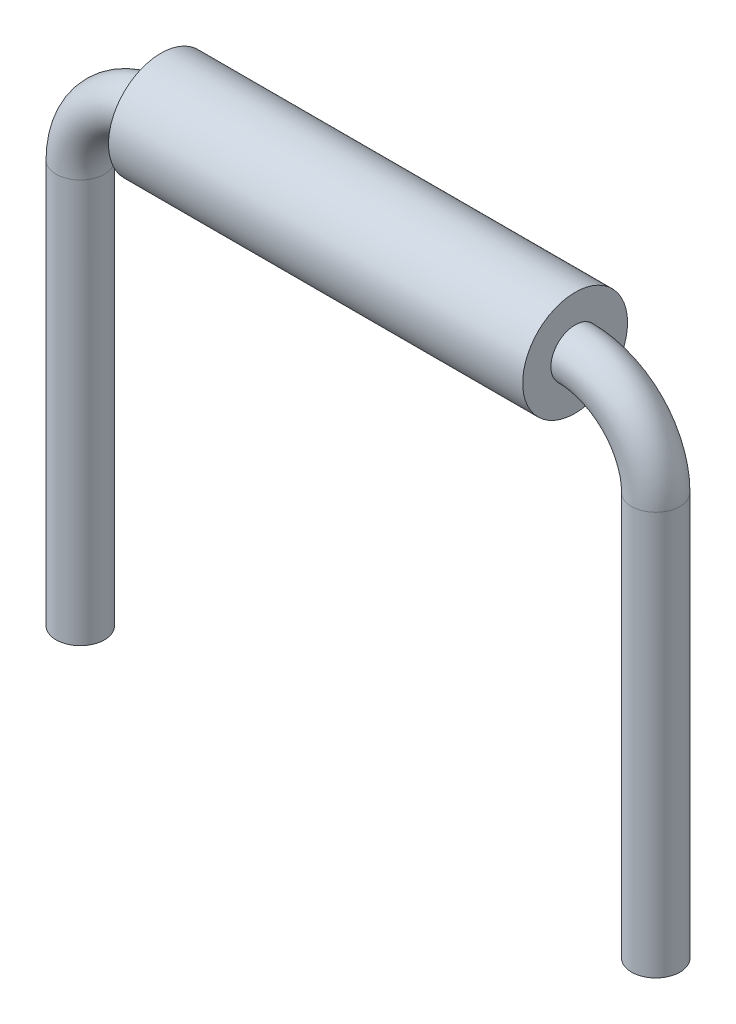
ISO-10303-21;
HEADER;
FILE_DESCRIPTION(('STEP AP214'),'2;1');
FILE_NAME('part.step','',(''),(''),'','','');
FILE_SCHEMA(('AUTOMOTIVE_DESIGN { 1 0 10303 214 1 1 1 1 }'));
ENDSEC;
DATA;
#1=APPLICATION_CONTEXT('core data for automotive mechanical design processes');
#2=APPLICATION_PROTOCOL_DEFINITION('international standard','automotive_design',2000,#1);
#3=PRODUCT_CONTEXT('',#1,'mechanical');
#4=PRODUCT('Part','Part','',(#3));
#5=PRODUCT_RELATED_PRODUCT_CATEGORY('part','',(#4));
#6=PRODUCT_DEFINITION_FORMATION('','',#4);
#7=PRODUCT_DEFINITION_CONTEXT('part definition',#1,'design');
#8=PRODUCT_DEFINITION('design','',#6,#7);
#9=PRODUCT_DEFINITION_SHAPE('','',#8);
#10=(LENGTH_UNIT() NAMED_UNIT(*) SI_UNIT(.MILLI.,.METRE.));
#11=(NAMED_UNIT(*) PLANE_ANGLE_UNIT() SI_UNIT($,.RADIAN.));
#12=(NAMED_UNIT(*) SI_UNIT($,.STERADIAN.) SOLID_ANGLE_UNIT());
#13=UNCERTAINTY_MEASURE_WITH_UNIT(LENGTH_MEASURE(1.E-05),#10,'distance_accuracy_value','');
#14=(GEOMETRIC_REPRESENTATION_CONTEXT(3) GLOBAL_UNCERTAINTY_ASSIGNED_CONTEXT((#13)) GLOBAL_UNIT_ASSIGNED_CONTEXT((#10,
#11,#12)) REPRESENTATION_CONTEXT('',''));
#15=CARTESIAN_POINT('',(0.,0.,0.));
#16=DIRECTION('',(0.,0.,1.));
#17=DIRECTION('',(1.,0.,0.));
#18=AXIS2_PLACEMENT_3D('',#15,#16,#17);
#19=CARTESIAN_POINT('',(2.5675,0.,0.));
#20=DIRECTION('',(1.,0.,0.));
#21=DIRECTION('',(0.,0.,-1.));
#22=AXIS2_PLACEMENT_3D('',#19,#20,#21);
#23=PLANE('',#22);
#24=CARTESIAN_POINT('',(2.5675,0.,0.));
#25=DIRECTION('',(1.,0.,0.));
#26=DIRECTION('',(0.,0.,-1.));
#27=AXIS2_PLACEMENT_3D('',#24,#25,#26);
#28=CIRCLE('',#27,0.65);
#29=CARTESIAN_POINT('',(2.5675,0.,-0.65));
#30=VERTEX_POINT('',#29);
#31=EDGE_CURVE('E11',#30,#30,#28,.T.);
#32=ORIENTED_EDGE('',*,*,#31,.T.);
#33=EDGE_LOOP('',(#32));
#34=FACE_BOUND('',#33,.T.);
#35=CARTESIAN_POINT('',(2.5675,0.,0.));
#36=DIRECTION('',(1.,0.,0.));
#37=DIRECTION('',(0.,0.,-1.));
#38=AXIS2_PLACEMENT_3D('',#35,#36,#37);
#39=CIRCLE('',#38,0.3);
#40=CARTESIAN_POINT('',(2.5675,0.,-0.3));
#41=VERTEX_POINT('',#40);
#42=EDGE_CURVE('E52',#41,#41,#39,.T.);
#43=ORIENTED_EDGE('',*,*,#42,.F.);
#44=EDGE_LOOP('',(#43));
#45=FACE_BOUND('',#44,.T.);
#46=ADVANCED_FACE('F45',(#34,#45),#23,.T.);
#47=CARTESIAN_POINT('',(2.5675,0.,0.));
#48=DIRECTION('',(-1.,0.,0.));
#49=DIRECTION('',(0.,0.,1.));
#50=AXIS2_PLACEMENT_3D('',#47,#48,#49);
#51=CYLINDRICAL_SURFACE('',#50,0.65);
#52=ORIENTED_EDGE('',*,*,#31,.F.);
#53=EDGE_LOOP('',(#52));
#54=FACE_BOUND('',#53,.T.);
#55=CARTESIAN_POINT('',(-2.5675,0.,0.));
#56=DIRECTION('',(1.,0.,0.));
#57=DIRECTION('',(0.,0.,-1.));
#58=AXIS2_PLACEMENT_3D('',#55,#56,#57);
#59=CIRCLE('',#58,0.65);
#60=CARTESIAN_POINT('',(-2.5675,0.,-0.65));
#61=VERTEX_POINT('',#60);
#62=EDGE_CURVE('E56',#61,#61,#59,.T.);
#63=ORIENTED_EDGE('',*,*,#62,.T.);
#64=EDGE_LOOP('',(#63));
#65=FACE_BOUND('',#64,.T.);
#66=ADVANCED_FACE('F47',(#54,#65),#51,.T.);
#67=CARTESIAN_POINT('',(2.5675,0.,0.));
#68=DIRECTION('',(-1.,0.,0.));
#69=DIRECTION('',(0.,0.,1.));
#70=AXIS2_PLACEMENT_3D('',#67,#68,#69);
#71=CYLINDRICAL_SURFACE('',#70,0.3);
#72=ORIENTED_EDGE('',*,*,#42,.T.);
#73=EDGE_LOOP('',(#72));
#74=FACE_BOUND('',#73,.T.);
#75=CARTESIAN_POINT('',(-2.5675,0.,0.));
#76=DIRECTION('',(1.,0.,0.));
#77=DIRECTION('',(0.,0.,-1.));
#78=AXIS2_PLACEMENT_3D('',#75,#76,#77);
#79=CIRCLE('',#78,0.3);
#80=CARTESIAN_POINT('',(-2.5675,0.,-0.3));
#81=VERTEX_POINT('',#80);
#82=EDGE_CURVE('E60',#81,#81,#79,.T.);
#83=ORIENTED_EDGE('',*,*,#82,.F.);
#84=EDGE_LOOP('',(#83));
#85=FACE_BOUND('',#84,.T.);
#86=ADVANCED_FACE('F69',(#74,#85),#71,.F.);
#87=CARTESIAN_POINT('',(-2.5675,0.,0.));
#88=DIRECTION('',(1.,0.,0.));
#89=DIRECTION('',(0.,0.,-1.));
#90=AXIS2_PLACEMENT_3D('',#87,#88,#89);
#91=PLANE('',#90);
#92=ORIENTED_EDGE('',*,*,#82,.T.);
#93=EDGE_LOOP('',(#92));
#94=FACE_BOUND('',#93,.T.);
#95=ORIENTED_EDGE('',*,*,#62,.F.);
#96=EDGE_LOOP('',(#95));
#97=FACE_BOUND('',#96,.T.);
#98=ADVANCED_FACE('F66',(#94,#97),#91,.F.);
#99=CLOSED_SHELL('',(#46,#66,#86,#98));
#100=MANIFOLD_SOLID_BREP('B2',#99);
#101=CARTESIAN_POINT('',(3.5675,-6.,0.));
#102=DIRECTION('',(0.,-1.,0.));
#103=DIRECTION('',(0.,0.,-1.));
#104=AXIS2_PLACEMENT_3D('',#101,#102,#103);
#105=PLANE('',#104);
#106=CARTESIAN_POINT('',(3.5675,-6.,0.));
#107=DIRECTION('',(0.,-1.,0.));
#108=DIRECTION('',(0.,0.,-1.));
#109=AXIS2_PLACEMENT_3D('',#106,#107,#108);
#110=CIRCLE('',#109,0.3);
#111=CARTESIAN_POINT('',(3.5675,-6.,-0.3));
#112=VERTEX_POINT('',#111);
#113=EDGE_CURVE('E129',#112,#112,#110,.T.);
#114=ORIENTED_EDGE('',*,*,#113,.T.);
#115=EDGE_LOOP('',(#114));
#116=FACE_BOUND('',#115,.T.);
#117=ADVANCED_FACE('F107',(#116),#105,.T.);
#118=CARTESIAN_POINT('',(-3.5675,-6.,0.));
#119=DIRECTION('',(0.,1.,0.));
#120=DIRECTION('',(0.,0.,-1.));
#121=AXIS2_PLACEMENT_3D('',#118,#119,#120);
#122=PLANE('',#121);
#123=CARTESIAN_POINT('',(-3.5675,-6.,0.));
#124=DIRECTION('',(0.,1.,0.));
#125=DIRECTION('',(0.,0.,-1.));
#126=AXIS2_PLACEMENT_3D('',#123,#124,#125);
#127=CIRCLE('',#126,0.3);
#128=CARTESIAN_POINT('',(-3.5675,-6.,-0.3));
#129=VERTEX_POINT('',#128);
#130=EDGE_CURVE('E44',#129,#129,#127,.T.);
#131=ORIENTED_EDGE('',*,*,#130,.F.);
#132=EDGE_LOOP('',(#131));
#133=FACE_BOUND('',#132,.T.);
#134=ADVANCED_FACE('F137',(#133),#122,.F.);
#135=CARTESIAN_POINT('',(3.5675,-6.,0.));
#136=DIRECTION('',(0.,1.,0.));
#137=DIRECTION('',(-1.,0.,0.));
#138=AXIS2_PLACEMENT_3D('',#135,#136,#137);
#139=CYLINDRICAL_SURFACE('',#138,0.3);
#140=CARTESIAN_POINT('',(3.5675,-0.999999999999999,0.));
#141=DIRECTION('',(0.,-1.,0.));
#142=DIRECTION('',(0.,0.,-1.));
#143=AXIS2_PLACEMENT_3D('',#140,#141,#142);
#144=CIRCLE('',#143,0.3);
#145=CARTESIAN_POINT('',(3.8675,-0.999999999999999,0.));
#146=VERTEX_POINT('',#145);
#147=EDGE_CURVE('E126',#146,#146,#144,.T.);
#148=ORIENTED_EDGE('',*,*,#147,.T.);
#149=EDGE_LOOP('',(#148));
#150=FACE_BOUND('',#149,.T.);
#151=ORIENTED_EDGE('',*,*,#113,.F.);
#152=EDGE_LOOP('',(#151));
#153=FACE_BOUND('',#152,.T.);
#154=ADVANCED_FACE('F134',(#150,#153),#139,.T.);
#155=CARTESIAN_POINT('',(2.5675,-0.999999999999999,0.));
#156=DIRECTION('',(0.,0.,1.));
#157=DIRECTION('',(1.,0.,0.));
#158=AXIS2_PLACEMENT_3D('',#155,#156,#157);
#159=TOROIDAL_SURFACE('',#158,1.,0.3);
#160=CARTESIAN_POINT('',(2.5675,0.,0.));
#161=DIRECTION('',(1.,0.,0.));
#162=DIRECTION('',(0.,0.,-1.));
#163=AXIS2_PLACEMENT_3D('',#160,#161,#162);
#164=CIRCLE('',#163,0.3);
#165=CARTESIAN_POINT('',(2.5675,0.3,0.));
#166=VERTEX_POINT('',#165);
#167=EDGE_CURVE('E121',#166,#166,#164,.T.);
#168=CARTESIAN_POINT('',(2.5675,-0.999999999999999,0.));
#169=DIRECTION('',(0.,0.,1.));
#170=DIRECTION('',(1.,0.,0.));
#171=AXIS2_PLACEMENT_3D('',#168,#169,#170);
#172=CIRCLE('',#171,1.3);
#173=EDGE_CURVE('',#146,#166,#172,.T.);
#174=ORIENTED_EDGE('',*,*,#147,.F.);
#175=ORIENTED_EDGE('',*,*,#167,.T.);
#176=ORIENTED_EDGE('',*,*,#173,.T.);
#177=ORIENTED_EDGE('',*,*,#173,.F.);
#178=EDGE_LOOP('',(#174,#176,#175,#177));
#179=FACE_BOUND('',#178,.T.);
#180=ADVANCED_FACE('F136',(#179),#159,.T.);
#181=CARTESIAN_POINT('',(2.5675,0.,0.));
#182=DIRECTION('',(-1.,0.,0.));
#183=DIRECTION('',(0.,-1.,0.));
#184=AXIS2_PLACEMENT_3D('',#181,#182,#183);
#185=CYLINDRICAL_SURFACE('',#184,0.3);
#186=CARTESIAN_POINT('',(-2.5675,0.,0.));
#187=DIRECTION('',(1.,0.,0.));
#188=DIRECTION('',(0.,0.,-1.));
#189=AXIS2_PLACEMENT_3D('',#186,#187,#188);
#190=CIRCLE('',#189,0.3);
#191=CARTESIAN_POINT('',(-2.5675,0.3,0.));
#192=VERTEX_POINT('',#191);
#193=EDGE_CURVE('E117',#192,#192,#190,.T.);
#194=ORIENTED_EDGE('',*,*,#193,.T.);
#195=EDGE_LOOP('',(#194));
#196=FACE_BOUND('',#195,.T.);
#197=ORIENTED_EDGE('',*,*,#167,.F.);
#198=EDGE_LOOP('',(#197));
#199=FACE_BOUND('',#198,.T.);
#200=ADVANCED_FACE('F144',(#196,#199),#185,.T.);
#201=CARTESIAN_POINT('',(-2.5675,-1.,0.));
#202=DIRECTION('',(0.,0.,1.));
#203=DIRECTION('',(1.,0.,0.));
#204=AXIS2_PLACEMENT_3D('',#201,#202,#203);
#205=TOROIDAL_SURFACE('',#204,1.,0.3);
#206=CARTESIAN_POINT('',(-3.5675,-1.,0.));
#207=DIRECTION('',(0.,1.,0.));
#208=DIRECTION('',(0.,0.,-1.));
#209=AXIS2_PLACEMENT_3D('',#206,#207,#208);
#210=CIRCLE('',#209,0.3);
#211=CARTESIAN_POINT('',(-3.8675,-1.,0.));
#212=VERTEX_POINT('',#211);
#213=EDGE_CURVE('E113',#212,#212,#210,.T.);
#214=CARTESIAN_POINT('',(-2.5675,-1.,0.));
#215=DIRECTION('',(0.,0.,1.));
#216=DIRECTION('',(1.,0.,0.));
#217=AXIS2_PLACEMENT_3D('',#214,#215,#216);
#218=CIRCLE('',#217,1.3);
#219=EDGE_CURVE('',#192,#212,#218,.T.);
#220=ORIENTED_EDGE('',*,*,#193,.F.);
#221=ORIENTED_EDGE('',*,*,#213,.T.);
#222=ORIENTED_EDGE('',*,*,#219,.T.);
#223=ORIENTED_EDGE('',*,*,#219,.F.);
#224=EDGE_LOOP('',(#220,#222,#221,#223));
#225=FACE_BOUND('',#224,.T.);
#226=ADVANCED_FACE('F150',(#225),#205,.T.);
#227=CARTESIAN_POINT('',(-3.5675,-1.,0.));
#228=DIRECTION('',(0.,-1.,0.));
#229=DIRECTION('',(1.,0.,0.));
#230=AXIS2_PLACEMENT_3D('',#227,#228,#229);
#231=CYLINDRICAL_SURFACE('',#230,0.3);
#232=ORIENTED_EDGE('',*,*,#130,.T.);
#233=EDGE_LOOP('',(#232));
#234=FACE_BOUND('',#233,.T.);
#235=ORIENTED_EDGE('',*,*,#213,.F.);
#236=EDGE_LOOP('',(#235));
#237=FACE_BOUND('',#236,.T.);
#238=ADVANCED_FACE('F148',(#234,#237),#231,.T.);
#239=CLOSED_SHELL('',(#117,#134,#154,#180,#200,#226,#238));
#240=MANIFOLD_SOLID_BREP('B6',#239);
#241=ADVANCED_BREP_SHAPE_REPRESENTATION('',(#18,#100,#240),#14);
#242=SHAPE_DEFINITION_REPRESENTATION(#9,#241);
ENDSEC;
END-ISO-10303-21;
